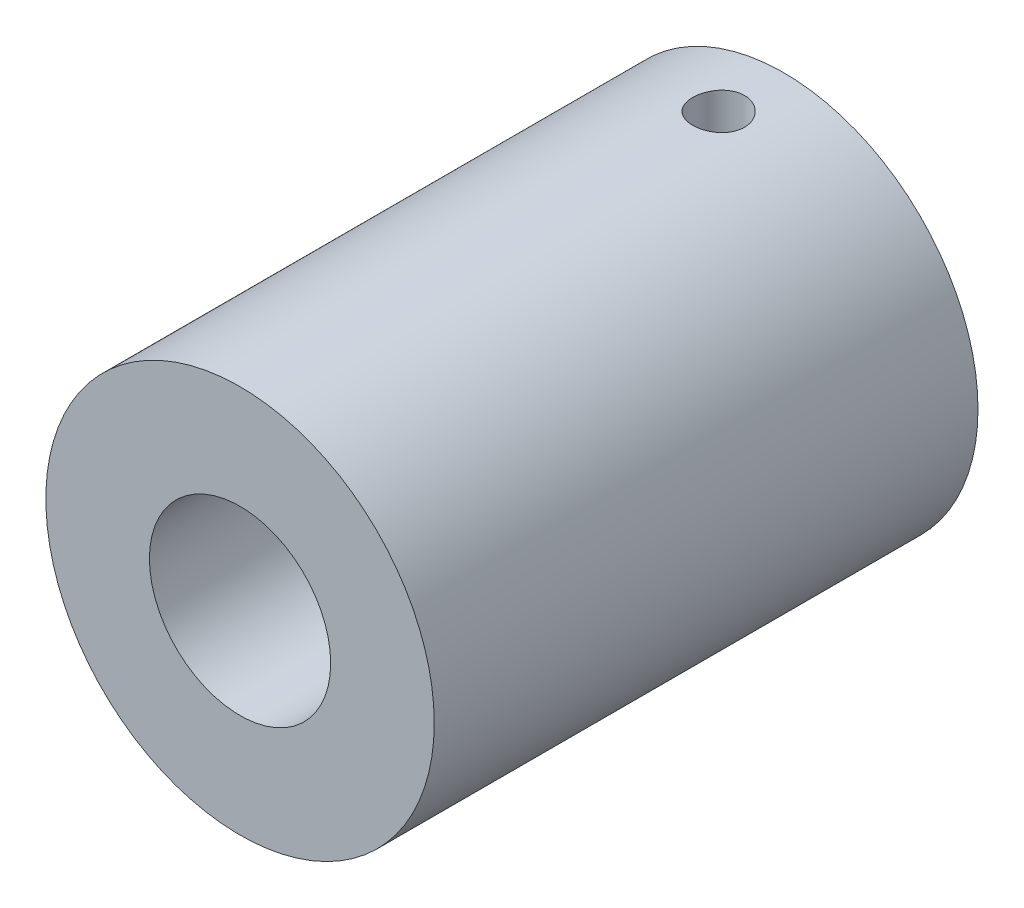
ISO-10303-21;
HEADER;
FILE_DESCRIPTION(('STEP AP214'),'2;1');
FILE_NAME('part.step','',(''),(''),'','','');
FILE_SCHEMA(('AUTOMOTIVE_DESIGN { 1 0 10303 214 1 1 1 1 }'));
ENDSEC;
DATA;
#1=APPLICATION_CONTEXT('core data for automotive mechanical design processes');
#2=APPLICATION_PROTOCOL_DEFINITION('international standard','automotive_design',2000,#1);
#3=PRODUCT_CONTEXT('',#1,'mechanical');
#4=PRODUCT('Part','Part','',(#3));
#5=PRODUCT_RELATED_PRODUCT_CATEGORY('part','',(#4));
#6=PRODUCT_DEFINITION_FORMATION('','',#4);
#7=PRODUCT_DEFINITION_CONTEXT('part definition',#1,'design');
#8=PRODUCT_DEFINITION('design','',#6,#7);
#9=PRODUCT_DEFINITION_SHAPE('','',#8);
#10=(LENGTH_UNIT() NAMED_UNIT(*) SI_UNIT(.MILLI.,.METRE.));
#11=(NAMED_UNIT(*) PLANE_ANGLE_UNIT() SI_UNIT($,.RADIAN.));
#12=(NAMED_UNIT(*) SI_UNIT($,.STERADIAN.) SOLID_ANGLE_UNIT());
#13=UNCERTAINTY_MEASURE_WITH_UNIT(LENGTH_MEASURE(1.E-05),#10,'distance_accuracy_value','');
#14=(GEOMETRIC_REPRESENTATION_CONTEXT(3) GLOBAL_UNCERTAINTY_ASSIGNED_CONTEXT((#13)) GLOBAL_UNIT_ASSIGNED_CONTEXT((#10,
#11,#12)) REPRESENTATION_CONTEXT('',''));
#15=CARTESIAN_POINT('',(0.,0.,0.));
#16=DIRECTION('',(0.,0.,1.));
#17=DIRECTION('',(1.,0.,0.));
#18=AXIS2_PLACEMENT_3D('',#15,#16,#17);
#19=CARTESIAN_POINT('',(0.,-2.37354368932038,42.));
#20=DIRECTION('',(0.,0.,-1.));
#21=DIRECTION('',(-1.,0.,0.));
#22=AXIS2_PLACEMENT_3D('',#19,#20,#21);
#23=CYLINDRICAL_SURFACE('',#22,15.);
#24=CARTESIAN_POINT('',(0.,12.6264563106796,7.03712164477432));
#25=CARTESIAN_POINT('',(-0.111808835669284,12.6264546681051,7.03711693506741));
#26=CARTESIAN_POINT('',(-0.22368597927628,12.6251930179516,7.02771410681185));
#27=CARTESIAN_POINT('',(-0.444322725138079,12.6202814219487,6.99035529572476));
#28=CARTESIAN_POINT('',(-0.553079022333037,12.6166290350969,6.96238034987717));
#29=CARTESIAN_POINT('',(-0.764248312626984,12.6073471091703,6.88871992723287));
#30=CARTESIAN_POINT('',(-0.866665683058494,12.6017189527893,6.84304683373588));
#31=CARTESIAN_POINT('',(-1.0623638950303,12.5891101772835,6.73531473096805));
#32=CARTESIAN_POINT('',(-1.15564620633702,12.5821297762653,6.67325836360786));
#33=CARTESIAN_POINT('',(-1.33102582250468,12.5675462585793,6.53410838317014));
#34=CARTESIAN_POINT('',(-1.41305798549586,12.5599398923007,6.45693299976585));
#35=CARTESIAN_POINT('',(-1.56304735673102,12.5449876862591,6.28991145569767));
#36=CARTESIAN_POINT('',(-1.63100381997221,12.537641860303,6.20006462477851));
#37=CARTESIAN_POINT('',(-1.75115902268907,12.5240106650815,6.00982252182929));
#38=CARTESIAN_POINT('',(-1.80329607482578,12.5177294883372,5.9093879622957));
#39=CARTESIAN_POINT('',(-1.8899384500729,12.5069821844719,5.70109057753754));
#40=CARTESIAN_POINT('',(-1.92444453245278,12.5025159791917,5.59322807242101));
#41=CARTESIAN_POINT('',(-1.97464606772174,12.4959356763663,5.37381583427267));
#42=CARTESIAN_POINT('',(-1.99045204228506,12.493807764381,5.2622918102414));
#43=CARTESIAN_POINT('',(-2.00314680548117,12.4921028267728,5.03815546516837));
#44=CARTESIAN_POINT('',(-2.00003645633601,12.4925256848836,4.92554319396343));
#45=CARTESIAN_POINT('',(-1.97507745939234,12.4958618684095,4.70320051474639));
#46=CARTESIAN_POINT('',(-1.95335097531762,12.498758956903,4.59345611488862));
#47=CARTESIAN_POINT('',(-1.89196724634371,12.5066918384271,4.37918480801423));
#48=CARTESIAN_POINT('',(-1.85230959261457,12.5117276802209,4.27465802001931));
#49=CARTESIAN_POINT('',(-1.75605929143191,12.5233889217899,4.07341201006713));
#50=CARTESIAN_POINT('',(-1.69941397913749,12.5300192519186,3.97671827358002));
#51=CARTESIAN_POINT('',(-1.57083393344289,12.544118672879,3.79416256285666));
#52=CARTESIAN_POINT('',(-1.49889840502385,12.5515878073149,3.70830115222016));
#53=CARTESIAN_POINT('',(-1.34110490026362,12.5665953030155,3.54913863219243));
#54=CARTESIAN_POINT('',(-1.25514170702645,12.5741337460916,3.475941802072));
#55=CARTESIAN_POINT('',(-1.07209417013341,12.5883755488622,3.34499959984593));
#56=CARTESIAN_POINT('',(-0.975009794442369,12.5950789061512,3.2872542722508));
#57=CARTESIAN_POINT('',(-0.772392219730469,12.6069002481154,3.18885252707958));
#58=CARTESIAN_POINT('',(-0.66685557884123,12.6120175827692,3.14820311372801));
#59=CARTESIAN_POINT('',(-0.450370924336249,12.6200845697203,3.08523232580198));
#60=CARTESIAN_POINT('',(-0.339423199542256,12.6230343375789,3.06290997413493));
#61=CARTESIAN_POINT('',(-0.116166903325643,12.6264187244482,3.0373632120032));
#62=CARTESIAN_POINT('',(-0.00387503454704207,12.6268722491701,3.03399524299084));
#63=CARTESIAN_POINT('',(0.219671617218718,12.6252642260648,3.0460733089015));
#64=CARTESIAN_POINT('',(0.330926425345665,12.6232027393656,3.06151888655668));
#65=CARTESIAN_POINT('',(0.548813715572938,12.6168080642606,3.11066629815831));
#66=CARTESIAN_POINT('',(0.655462016512045,12.6124834537088,3.14429921309647));
#67=CARTESIAN_POINT('',(0.86160509879356,12.6020464032225,3.22879461071141));
#68=CARTESIAN_POINT('',(0.961099607015638,12.595933895074,3.27965775078758));
#69=CARTESIAN_POINT('',(1.15074887861608,12.5825546843804,3.39751380035763));
#70=CARTESIAN_POINT('',(1.2408458143966,12.5752814611368,3.46459901048766));
#71=CARTESIAN_POINT('',(1.4085529469919,12.5604135977794,3.61286497399858));
#72=CARTESIAN_POINT('',(1.48616257662379,12.5528189430858,3.69404636729076));
#73=CARTESIAN_POINT('',(1.62720549423098,12.5381053354147,3.86883478741387));
#74=CARTESIAN_POINT('',(1.69054327608938,12.5309897984326,3.96251921151248));
#75=CARTESIAN_POINT('',(1.80058351078814,12.5180976406978,4.15928105505525));
#76=CARTESIAN_POINT('',(1.84728633510346,12.5123209900475,4.2623582646847));
#77=CARTESIAN_POINT('',(1.92257836500746,12.5027844284804,4.47467888680202));
#78=CARTESIAN_POINT('',(1.95122028846795,12.4990186530056,4.58390332998513));
#79=CARTESIAN_POINT('',(1.98974667143959,12.4939137976625,4.80566527690308));
#80=CARTESIAN_POINT('',(1.99963213426782,12.492574587993,4.91820260309876));
#81=CARTESIAN_POINT('',(2.00034485806189,12.4924786236341,5.14244513562783));
#82=CARTESIAN_POINT('',(1.99132219194493,12.4937015335048,5.25414988573856));
#83=CARTESIAN_POINT('',(1.95479376686689,12.4985481494216,5.47443951987819));
#84=CARTESIAN_POINT('',(1.92728801483269,12.5021718545679,5.5830244050763));
#85=CARTESIAN_POINT('',(1.85462310332207,12.5114052134072,5.79396532802591));
#86=CARTESIAN_POINT('',(1.80947220819041,12.5170139372736,5.89632425589118));
#87=CARTESIAN_POINT('',(1.70281342759737,12.5295867678078,6.09203752860039));
#88=CARTESIAN_POINT('',(1.64130522630429,12.5365509006456,6.18539169953037));
#89=CARTESIAN_POINT('',(1.50312448509508,12.5511159825102,6.36121129470273));
#90=CARTESIAN_POINT('',(1.42634027226901,12.5587213682204,6.44358859252945));
#91=CARTESIAN_POINT('',(1.26002169349824,12.5736735006962,6.59434486113587));
#92=CARTESIAN_POINT('',(1.17048434072978,12.5810201863694,6.66272054352457));
#93=CARTESIAN_POINT('',(0.980752987852823,12.5946626620549,6.78378878324084));
#94=CARTESIAN_POINT('',(0.880514620743966,12.6009537749485,6.83641231132957));
#95=CARTESIAN_POINT('',(0.672592409587329,12.6117295172693,6.9240022433194));
#96=CARTESIAN_POINT('',(0.564916678969889,12.6162160799227,6.95898755339918));
#97=CARTESIAN_POINT('',(0.380588408098418,12.6218135281123,7.0020696511595));
#98=CARTESIAN_POINT('',(0.305091081955778,12.6235459470304,7.01519488829796));
#99=CARTESIAN_POINT('',(0.153073171616111,12.6258678955873,7.0327224589398));
#100=CARTESIAN_POINT('',(0.0765525964512399,12.6264574353076,7.03712486938793));
#101=CARTESIAN_POINT('',(0.,12.6264563106796,7.03712164477432));
#102=B_SPLINE_CURVE_WITH_KNOTS('',3,(#24,#25,#26,#27,#28,#29,#30,#31,#32,#33,#34,#35,#36,#37,
#38,#39,#40,#41,#42,#43,#44,#45,#46,#47,#48,#49,#50,#51,#52,#53,#54,#55,#56,#57,#58,#59,#60,#61,
#62,#63,#64,#65,#66,#67,#68,#69,#70,#71,#72,#73,#74,#75,#76,#77,#78,#79,#80,#81,#82,#83,#84,#85,
#86,#87,#88,#89,#90,#91,#92,#93,#94,#95,#96,#97,#98,#99,#100,#101),.UNSPECIFIED.,.T.,.F.,(4,2,2,
2,2,2,2,2,2,2,2,2,2,2,2,2,2,2,2,2,2,2,2,2,2,2,2,2,2,2,2,2,2,2,2,2,2,2,4),(0.,0.335146851305743,
0.670636430885044,1.0058916928274,1.34109292564035,1.67815978443559,2.01524447904836,
2.35362721511647,2.69199537766205,3.02835355914359,3.3646964092492,3.69884885098043,
4.0330089117585,4.36821583137898,4.70344018443797,5.04130544484849,5.37917167852296,
5.71717620202538,6.05516270391743,6.39058584992061,6.72600084354478,7.06015363396463,
7.39431917503546,7.73043274769884,8.06656158258761,8.4048770453545,8.74318495273048,
9.08050074735454,9.41779849783634,9.75242927496624,10.0870599266874,10.4215340370262,
10.756014605959,11.0930366783511,11.4301378125116,11.7686952667452,12.1068890499242,
12.3363573904731,12.5658237068544),.UNSPECIFIED.);
#103=CARTESIAN_POINT('',(0.,12.6264563106796,7.03712164477432));
#104=VERTEX_POINT('',#103);
#105=EDGE_CURVE('E61',#104,#104,#102,.T.);
#106=ORIENTED_EDGE('',*,*,#105,.T.);
#107=EDGE_LOOP('',(#106));
#108=FACE_BOUND('',#107,.T.);
#109=CARTESIAN_POINT('',(0.,-2.37354368932038,42.));
#110=DIRECTION('',(0.,0.,1.));
#111=DIRECTION('',(1.,0.,0.));
#112=AXIS2_PLACEMENT_3D('',#109,#110,#111);
#113=CIRCLE('',#112,15.);
#114=CARTESIAN_POINT('',(15.,-2.37354368932038,42.));
#115=VERTEX_POINT('',#114);
#116=EDGE_CURVE('E10',#115,#115,#113,.T.);
#117=ORIENTED_EDGE('',*,*,#116,.F.);
#118=EDGE_LOOP('',(#117));
#119=FACE_BOUND('',#118,.T.);
#120=CARTESIAN_POINT('',(0.,-2.37354368932038,0.));
#121=DIRECTION('',(0.,0.,1.));
#122=DIRECTION('',(1.,0.,0.));
#123=AXIS2_PLACEMENT_3D('',#120,#121,#122);
#124=CIRCLE('',#123,15.);
#125=CARTESIAN_POINT('',(15.,-2.37354368932038,0.));
#126=VERTEX_POINT('',#125);
#127=EDGE_CURVE('E45',#126,#126,#124,.T.);
#128=ORIENTED_EDGE('',*,*,#127,.T.);
#129=EDGE_LOOP('',(#128));
#130=FACE_BOUND('',#129,.T.);
#131=ADVANCED_FACE('F33',(#108,#119,#130),#23,.T.);
#132=CARTESIAN_POINT('',(0.,-2.37354368932038,42.));
#133=DIRECTION('',(0.,0.,1.));
#134=DIRECTION('',(1.,0.,0.));
#135=AXIS2_PLACEMENT_3D('',#132,#133,#134);
#136=PLANE('',#135);
#137=CARTESIAN_POINT('',(0.,-2.37354368932038,42.));
#138=DIRECTION('',(0.,0.,1.));
#139=DIRECTION('',(1.,0.,0.));
#140=AXIS2_PLACEMENT_3D('',#137,#138,#139);
#141=CIRCLE('',#140,7.);
#142=CARTESIAN_POINT('',(7.,-2.37354368932038,42.));
#143=VERTEX_POINT('',#142);
#144=EDGE_CURVE('E52',#143,#143,#141,.T.);
#145=ORIENTED_EDGE('',*,*,#144,.F.);
#146=EDGE_LOOP('',(#145));
#147=FACE_BOUND('',#146,.T.);
#148=ORIENTED_EDGE('',*,*,#116,.T.);
#149=EDGE_LOOP('',(#148));
#150=FACE_BOUND('',#149,.T.);
#151=ADVANCED_FACE('F90',(#147,#150),#136,.T.);
#152=CARTESIAN_POINT('',(0.,-2.37354368932038,0.));
#153=DIRECTION('',(0.,0.,1.));
#154=DIRECTION('',(1.,0.,0.));
#155=AXIS2_PLACEMENT_3D('',#152,#153,#154);
#156=PLANE('',#155);
#157=CARTESIAN_POINT('',(0.,-2.37354368932038,0.));
#158=DIRECTION('',(0.,0.,-1.));
#159=DIRECTION('',(-1.,0.,0.));
#160=AXIS2_PLACEMENT_3D('',#157,#158,#159);
#161=CIRCLE('',#160,5.);
#162=CARTESIAN_POINT('',(-5.,-2.37354368932038,0.));
#163=VERTEX_POINT('',#162);
#164=EDGE_CURVE('E58',#163,#163,#161,.T.);
#165=ORIENTED_EDGE('',*,*,#164,.F.);
#166=EDGE_LOOP('',(#165));
#167=FACE_BOUND('',#166,.T.);
#168=ORIENTED_EDGE('',*,*,#127,.F.);
#169=EDGE_LOOP('',(#168));
#170=FACE_BOUND('',#169,.T.);
#171=ADVANCED_FACE('F88',(#167,#170),#156,.F.);
#172=CARTESIAN_POINT('',(0.,-2.37354368932038,22.));
#173=DIRECTION('',(0.,0.,1.));
#174=DIRECTION('',(1.,0.,0.));
#175=AXIS2_PLACEMENT_3D('',#172,#173,#174);
#176=CYLINDRICAL_SURFACE('',#175,7.);
#177=CARTESIAN_POINT('',(0.,-2.37354368932038,22.));
#178=DIRECTION('',(0.,0.,1.));
#179=DIRECTION('',(1.,0.,0.));
#180=AXIS2_PLACEMENT_3D('',#177,#178,#179);
#181=CIRCLE('',#180,7.);
#182=CARTESIAN_POINT('',(7.,-2.37354368932038,22.));
#183=VERTEX_POINT('',#182);
#184=EDGE_CURVE('E50',#183,#183,#181,.T.);
#185=ORIENTED_EDGE('',*,*,#184,.F.);
#186=EDGE_LOOP('',(#185));
#187=FACE_BOUND('',#186,.T.);
#188=ORIENTED_EDGE('',*,*,#144,.T.);
#189=EDGE_LOOP('',(#188));
#190=FACE_BOUND('',#189,.T.);
#191=ADVANCED_FACE('F84',(#187,#190),#176,.F.);
#192=CARTESIAN_POINT('',(0.,-2.37354368932038,22.));
#193=DIRECTION('',(0.,0.,1.));
#194=DIRECTION('',(1.,0.,0.));
#195=AXIS2_PLACEMENT_3D('',#192,#193,#194);
#196=PLANE('',#195);
#197=ORIENTED_EDGE('',*,*,#184,.T.);
#198=EDGE_LOOP('',(#197));
#199=FACE_BOUND('',#198,.T.);
#200=ADVANCED_FACE('F80',(#199),#196,.T.);
#201=CARTESIAN_POINT('',(0.,-2.37354368932038,20.));
#202=DIRECTION('',(0.,0.,-1.));
#203=DIRECTION('',(-1.,0.,0.));
#204=AXIS2_PLACEMENT_3D('',#201,#202,#203);
#205=CYLINDRICAL_SURFACE('',#204,5.);
#206=CARTESIAN_POINT('',(0.,2.62645631067962,7.03712164477432));
#207=CARTESIAN_POINT('',(0.107493005442891,2.62644902295046,7.0371117929506));
#208=CARTESIAN_POINT('',(0.215172564090673,2.62294925374894,7.02840389268595));
#209=CARTESIAN_POINT('',(0.427496480417896,2.60929084168603,6.99387394125309));
#210=CARTESIAN_POINT('',(0.532131777561248,2.59911409766839,6.96800536568819));
#211=CARTESIAN_POINT('',(0.734953922727403,2.5731984028108,6.90024556671549));
#212=CARTESIAN_POINT('',(0.833160661616958,2.55747767432034,6.85840679855759));
#213=CARTESIAN_POINT('',(1.02107197032837,2.5220224186404,6.76010247144778));
#214=CARTESIAN_POINT('',(1.11077947675099,2.50228928526018,6.70364198985539));
#215=CARTESIAN_POINT('',(1.28350100757039,2.4597651723838,6.57488614621339));
#216=CARTESIAN_POINT('',(1.36606227255021,2.43687927997152,6.50201498853406));
#217=CARTESIAN_POINT('',(1.51817500478472,2.39106207974156,6.34372164129755));
#218=CARTESIAN_POINT('',(1.58772010713353,2.36813075521754,6.25829334756258));
#219=CARTESIAN_POINT('',(1.71487456729288,2.32368422865098,6.07269357453206));
#220=CARTESIAN_POINT('',(1.77181498119547,2.30227747032913,5.97203515875113));
#221=CARTESIAN_POINT('',(1.86775471903715,2.26479278254754,5.76158524635428));
#222=CARTESIAN_POINT('',(1.90676256428583,2.24871232312137,5.65179811692596));
#223=CARTESIAN_POINT('',(1.96389882339587,2.2247198872878,5.43140931118222));
#224=CARTESIAN_POINT('',(1.98289396580565,2.21647051423567,5.32107040919811));
#225=CARTESIAN_POINT('',(2.00217296164003,2.20809635117106,5.09848664646706));
#226=CARTESIAN_POINT('',(2.00246601631322,2.2079675659073,4.98624275014931));
#227=CARTESIAN_POINT('',(1.98498936750454,2.21556131347956,4.77136497331628));
#228=CARTESIAN_POINT('',(1.96847531430514,2.22273806106412,4.66860593036529));
#229=CARTESIAN_POINT('',(1.91994688029782,2.24321818675798,4.46746208876761));
#230=CARTESIAN_POINT('',(1.88792979480463,2.25652263389634,4.36907805666402));
#231=CARTESIAN_POINT('',(1.80869473255107,2.28805116156492,4.17710380857828));
#232=CARTESIAN_POINT('',(1.76117986231532,2.30637010348749,4.08365240571963));
#233=CARTESIAN_POINT('',(1.65250646073221,2.34583747457851,3.90570582841276));
#234=CARTESIAN_POINT('',(1.59134280510084,2.3669869652481,3.82121403537152));
#235=CARTESIAN_POINT('',(1.45155059945443,2.41172367810232,3.65671191597233));
#236=CARTESIAN_POINT('',(1.37193746297064,2.43537296044113,3.57755291532831));
#237=CARTESIAN_POINT('',(1.20031442743019,2.48105456026243,3.43343716677228));
#238=CARTESIAN_POINT('',(1.10830206533443,2.50308655513286,3.36848324736403));
#239=CARTESIAN_POINT('',(0.912077652605843,2.5436031233251,3.25350419735849));
#240=CARTESIAN_POINT('',(0.807660491346478,2.56200901163376,3.20379936357727));
#241=CARTESIAN_POINT('',(0.591023765482882,2.5926045939672,3.12295378369627));
#242=CARTESIAN_POINT('',(0.478808196849674,2.60479744530344,3.09180360721691));
#243=CARTESIAN_POINT('',(0.256895887607821,2.62101770574872,3.05067334935462));
#244=CARTESIAN_POINT('',(0.147443293985535,2.62548576901476,3.03954919052076));
#245=CARTESIAN_POINT('',(-0.0718453098078164,2.62714109578592,3.03540854424571));
#246=CARTESIAN_POINT('',(-0.181681213223923,2.62433024650253,3.04238736322681));
#247=CARTESIAN_POINT('',(-0.393432739121987,2.61203198131715,3.07341339732631));
#248=CARTESIAN_POINT('',(-0.495482491775474,2.60285022413485,3.0966796251253));
#249=CARTESIAN_POINT('',(-0.69413542806078,2.57905072473462,3.15855735308414));
#250=CARTESIAN_POINT('',(-0.790737910224844,2.56443228424492,3.197170824443));
#251=CARTESIAN_POINT('',(-0.979078785816702,2.53062225838773,3.28990658445427));
#252=CARTESIAN_POINT('',(-1.07057802275541,2.51130447047765,3.34446711681747));
#253=CARTESIAN_POINT('',(-1.24344359124655,2.47018995813486,3.46706196867997));
#254=CARTESIAN_POINT('',(-1.32480584076112,2.44839224178232,3.53510168769694));
#255=CARTESIAN_POINT('',(-1.48072304302882,2.40290748706073,3.68799165772395));
#256=CARTESIAN_POINT('',(-1.55447393380606,2.37919072493013,3.77365518628053));
#257=CARTESIAN_POINT('',(-1.68675119741371,2.33387303985094,3.95656172778369));
#258=CARTESIAN_POINT('',(-1.74527506133751,2.31227246594472,4.05380664511427));
#259=CARTESIAN_POINT('',(-1.84580750193163,2.2735993097567,4.25858333936843));
#260=CARTESIAN_POINT('',(-1.88765059453445,2.25657261952749,4.36620564398663));
#261=CARTESIAN_POINT('',(-1.9522962197053,2.22969304545893,4.58785529648948));
#262=CARTESIAN_POINT('',(-1.97511280526932,2.2198348676396,4.70187785058675));
#263=CARTESIAN_POINT('',(-1.9997156172784,2.20917390367888,4.92424954654887));
#264=CARTESIAN_POINT('',(-2.00289708230287,2.20777052076133,5.03241648436767));
#265=CARTESIAN_POINT('',(-1.99180315927752,2.21260467101059,5.24766650248762));
#266=CARTESIAN_POINT('',(-1.97752998791378,2.21884123392755,5.35474971867691));
#267=CARTESIAN_POINT('',(-1.93307136615365,2.23772280146982,5.56045383462936));
#268=CARTESIAN_POINT('',(-1.90353749357098,2.25010462895411,5.65924191920732));
#269=CARTESIAN_POINT('',(-1.83000544849101,2.27969632300658,5.85050027438781));
#270=CARTESIAN_POINT('',(-1.78600328139381,2.29690752273968,5.94296879167415));
#271=CARTESIAN_POINT('',(-1.68187276275973,2.33544240672453,6.1247312640451));
#272=CARTESIAN_POINT('',(-1.62096533515949,2.35694513381203,6.21354031490481));
#273=CARTESIAN_POINT('',(-1.48589211927149,2.40109435440199,6.38011496197808));
#274=CARTESIAN_POINT('',(-1.41172233481812,2.42374119116368,6.45787721690264));
#275=CARTESIAN_POINT('',(-1.24650550627246,2.46939198155356,6.60532449803794));
#276=CARTESIAN_POINT('',(-1.15467600114614,2.49232389030147,6.67415895167239));
#277=CARTESIAN_POINT('',(-0.959900320285779,2.53446037781678,6.79545868739596));
#278=CARTESIAN_POINT('',(-0.856949004547238,2.55366322160868,6.84791635692685));
#279=CARTESIAN_POINT('',(-0.644738062495203,2.58585345883823,6.93374385996461));
#280=CARTESIAN_POINT('',(-0.535631618219696,2.59894994122989,6.96745096833466));
#281=CARTESIAN_POINT('',(-0.31287654628122,2.61789937277327,7.01576076572859));
#282=CARTESIAN_POINT('',(-0.199243525858912,2.62377530563599,7.03042408151822));
#283=CARTESIAN_POINT('',(-0.0569122978909295,2.62621530572098,7.0365170257526));
#284=CARTESIAN_POINT('',(-0.0284626887407583,2.62645824037137,7.03712425340352));
#285=CARTESIAN_POINT('',(0.,2.62645631067962,7.03712164477432));
#286=B_SPLINE_CURVE_WITH_KNOTS('',3,(#206,#207,#208,#209,#210,#211,#212,#213,#214,#215,#216,
#217,#218,#219,#220,#221,#222,#223,#224,#225,#226,#227,#228,#229,#230,#231,#232,#233,#234,#235,
#236,#237,#238,#239,#240,#241,#242,#243,#244,#245,#246,#247,#248,#249,#250,#251,#252,#253,#254,
#255,#256,#257,#258,#259,#260,#261,#262,#263,#264,#265,#266,#267,#268,#269,#270,#271,#272,#273,
#274,#275,#276,#277,#278,#279,#280,#281,#282,#283,#284,#285),.UNSPECIFIED.,.T.,.F.,(4,2,2,2,2,2,
2,2,2,2,2,2,2,2,2,2,2,2,2,2,2,2,2,2,2,2,2,2,2,2,2,2,2,2,2,2,2,2,2,4),(0.,0.322402987893071,
0.645683636007934,0.96791145747158,1.29002753567984,1.62597381700397,1.96208394934411,
2.31315258819217,2.66405423118268,2.99904105308828,3.33386306340488,3.64538328401372,
3.95695787256047,4.27489126298816,4.59294421938183,4.93558349186557,5.27829092839733,
5.62776913162806,5.9770695611379,6.30569184528007,6.63422893570082,6.94800455564365,
7.26182048993796,7.58523513398262,7.90877959498969,8.25368474624413,8.59864669043748,
8.94695045140827,9.29499672645934,9.61799673392748,9.94095572563046,10.2511431854877,
10.5614163580516,10.8894546805669,11.2175920134839,11.5670042353384,11.9165786364053,
12.2596430101332,12.6016125240434,12.686980458968),.UNSPECIFIED.);
#287=CARTESIAN_POINT('',(0.,2.62645631067962,7.03712164477432));
#288=VERTEX_POINT('',#287);
#289=EDGE_CURVE('E37',#288,#288,#286,.T.);
#290=ORIENTED_EDGE('',*,*,#289,.T.);
#291=EDGE_LOOP('',(#290));
#292=FACE_BOUND('',#291,.T.);
#293=CARTESIAN_POINT('',(0.,-2.37354368932038,20.));
#294=DIRECTION('',(0.,0.,-1.));
#295=DIRECTION('',(-1.,0.,0.));
#296=AXIS2_PLACEMENT_3D('',#293,#294,#295);
#297=CIRCLE('',#296,5.);
#298=CARTESIAN_POINT('',(-5.,-2.37354368932038,20.));
#299=VERTEX_POINT('',#298);
#300=EDGE_CURVE('E55',#299,#299,#297,.T.);
#301=ORIENTED_EDGE('',*,*,#300,.F.);
#302=EDGE_LOOP('',(#301));
#303=FACE_BOUND('',#302,.T.);
#304=ORIENTED_EDGE('',*,*,#164,.T.);
#305=EDGE_LOOP('',(#304));
#306=FACE_BOUND('',#305,.T.);
#307=ADVANCED_FACE('F75',(#292,#303,#306),#205,.F.);
#308=CARTESIAN_POINT('',(0.,-2.37354368932038,20.));
#309=DIRECTION('',(0.,0.,-1.));
#310=DIRECTION('',(-1.,0.,0.));
#311=AXIS2_PLACEMENT_3D('',#308,#309,#310);
#312=PLANE('',#311);
#313=ORIENTED_EDGE('',*,*,#300,.T.);
#314=EDGE_LOOP('',(#313));
#315=FACE_BOUND('',#314,.T.);
#316=ADVANCED_FACE('F71',(#315),#312,.T.);
#317=CARTESIAN_POINT('',(0.,0.,5.03712164477432));
#318=DIRECTION('',(0.,1.,0.));
#319=DIRECTION('',(0.,0.,1.));
#320=AXIS2_PLACEMENT_3D('',#317,#318,#319);
#321=CYLINDRICAL_SURFACE('',#320,2.);
#322=ORIENTED_EDGE('',*,*,#289,.F.);
#323=EDGE_LOOP('',(#322));
#324=FACE_BOUND('',#323,.T.);
#325=ORIENTED_EDGE('',*,*,#105,.F.);
#326=EDGE_LOOP('',(#325));
#327=FACE_BOUND('',#326,.T.);
#328=ADVANCED_FACE('F67',(#324,#327),#321,.F.);
#329=CLOSED_SHELL('',(#131,#151,#171,#191,#200,#307,#316,#328));
#330=MANIFOLD_SOLID_BREP('B2',#329);
#331=ADVANCED_BREP_SHAPE_REPRESENTATION('',(#18,#330),#14);
#332=SHAPE_DEFINITION_REPRESENTATION(#9,#331);
ENDSEC;
END-ISO-10303-21;
